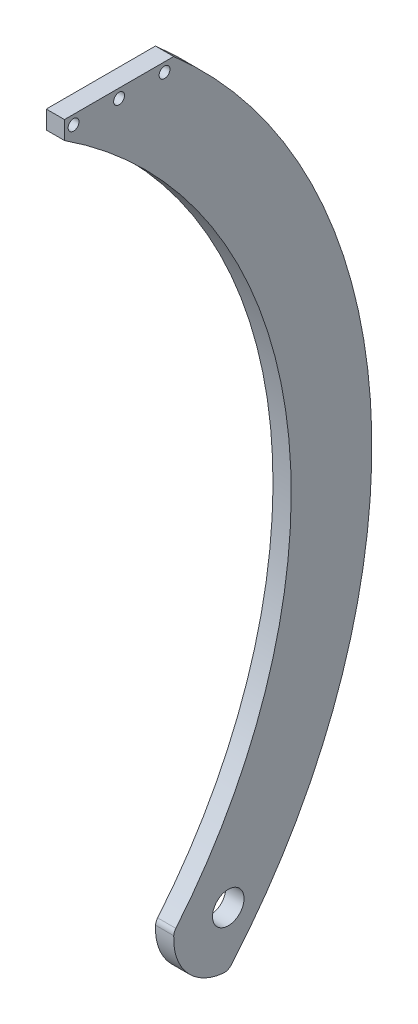
ISO-10303-21;
HEADER;
FILE_DESCRIPTION(('STEP AP214'),'2;1');
FILE_NAME('part.step','',(''),(''),'','','');
FILE_SCHEMA(('AUTOMOTIVE_DESIGN { 1 0 10303 214 1 1 1 1 }'));
ENDSEC;
DATA;
#1=APPLICATION_CONTEXT('core data for automotive mechanical design processes');
#2=APPLICATION_PROTOCOL_DEFINITION('international standard','automotive_design',2000,#1);
#3=PRODUCT_CONTEXT('',#1,'mechanical');
#4=PRODUCT('Part','Part','',(#3));
#5=PRODUCT_RELATED_PRODUCT_CATEGORY('part','',(#4));
#6=PRODUCT_DEFINITION_FORMATION('','',#4);
#7=PRODUCT_DEFINITION_CONTEXT('part definition',#1,'design');
#8=PRODUCT_DEFINITION('design','',#6,#7);
#9=PRODUCT_DEFINITION_SHAPE('','',#8);
#10=(LENGTH_UNIT() NAMED_UNIT(*) SI_UNIT(.MILLI.,.METRE.));
#11=(NAMED_UNIT(*) PLANE_ANGLE_UNIT() SI_UNIT($,.RADIAN.));
#12=(NAMED_UNIT(*) SI_UNIT($,.STERADIAN.) SOLID_ANGLE_UNIT());
#13=UNCERTAINTY_MEASURE_WITH_UNIT(LENGTH_MEASURE(1.E-05),#10,'distance_accuracy_value','');
#14=(GEOMETRIC_REPRESENTATION_CONTEXT(3) GLOBAL_UNCERTAINTY_ASSIGNED_CONTEXT((#13)) GLOBAL_UNIT_ASSIGNED_CONTEXT((#10,
#11,#12)) REPRESENTATION_CONTEXT('',''));
#15=CARTESIAN_POINT('',(0.,0.,0.));
#16=DIRECTION('',(0.,0.,1.));
#17=DIRECTION('',(1.,0.,0.));
#18=AXIS2_PLACEMENT_3D('',#15,#16,#17);
#19=CARTESIAN_POINT('',(6.35,114.3,114.3));
#20=DIRECTION('',(-1.,0.,0.));
#21=DIRECTION('',(0.,0.,1.));
#22=AXIS2_PLACEMENT_3D('',#19,#20,#21);
#23=PLANE('',#22);
#24=CARTESIAN_POINT('',(6.35,263.525,-15.875));
#25=DIRECTION('',(1.,0.,0.));
#26=DIRECTION('',(0.,0.,-1.));
#27=AXIS2_PLACEMENT_3D('',#24,#25,#26);
#28=CIRCLE('',#27,1.89865);
#29=CARTESIAN_POINT('',(6.35,263.525,-17.77365));
#30=VERTEX_POINT('',#29);
#31=EDGE_CURVE('E194',#30,#30,#28,.T.);
#32=ORIENTED_EDGE('',*,*,#31,.F.);
#33=EDGE_LOOP('',(#32));
#34=FACE_BOUND('',#33,.T.);
#35=CARTESIAN_POINT('',(6.35,114.3,114.3));
#36=DIRECTION('',(1.,0.,0.));
#37=DIRECTION('',(0.,0.,1.));
#38=AXIS2_PLACEMENT_3D('',#35,#36,#37);
#39=CIRCLE('',#38,202.504277732595);
#40=CARTESIAN_POINT('',(6.35,-17.8861216095722,-39.1105985706965));
#41=VERTEX_POINT('',#40);
#42=CARTESIAN_POINT('',(6.35,266.7,-19.05));
#43=VERTEX_POINT('',#42);
#44=EDGE_CURVE('E155',#41,#43,#39,.T.);
#45=ORIENTED_EDGE('',*,*,#44,.T.);
#46=DIRECTION('',(0.,0.,1.));
#47=VECTOR('',#46,1.);
#48=CARTESIAN_POINT('',(6.35,266.7,19.05));
#49=LINE('',#48,#47);
#50=CARTESIAN_POINT('',(6.35,266.7,19.05));
#51=VERTEX_POINT('',#50);
#52=EDGE_CURVE('E102',#43,#51,#49,.T.);
#53=ORIENTED_EDGE('',*,*,#52,.T.);
#54=DIRECTION('',(0.,-1.,0.));
#55=VECTOR('',#54,1.);
#56=CARTESIAN_POINT('',(6.35,266.7,19.05));
#57=LINE('',#56,#55);
#58=CARTESIAN_POINT('',(6.35,260.35,19.05));
#59=VERTEX_POINT('',#58);
#60=EDGE_CURVE('E170',#51,#59,#57,.T.);
#61=ORIENTED_EDGE('',*,*,#60,.T.);
#62=CARTESIAN_POINT('',(6.35,114.3,114.3));
#63=DIRECTION('',(-1.,0.,0.));
#64=DIRECTION('',(0.,0.,1.));
#65=AXIS2_PLACEMENT_3D('',#62,#63,#64);
#66=CIRCLE('',#65,174.365033765374);
#67=CARTESIAN_POINT('',(6.35,2.85913384459888,-19.8048036072309));
#68=VERTEX_POINT('',#67);
#69=EDGE_CURVE('E120',#59,#68,#66,.T.);
#70=ORIENTED_EDGE('',*,*,#69,.T.);
#71=CARTESIAN_POINT('',(6.35,0.829915357367626,-22.2467080548043));
#72=DIRECTION('',(1.,0.,0.));
#73=DIRECTION('',(0.,0.,1.));
#74=AXIS2_PLACEMENT_3D('',#71,#72,#73);
#75=CIRCLE('',#74,3.175);
#76=CARTESIAN_POINT('',(6.35,0.99589842884115,-19.0760496657652));
#77=VERTEX_POINT('',#76);
#78=EDGE_CURVE('E114',#68,#77,#75,.T.);
#79=ORIENTED_EDGE('',*,*,#78,.T.);
#80=CARTESIAN_POINT('',(6.35,0.,-38.1));
#81=DIRECTION('',(1.,0.,0.));
#82=DIRECTION('',(0.,0.,-1.));
#83=AXIS2_PLACEMENT_3D('',#80,#81,#82);
#84=CIRCLE('',#83,19.0500000000002);
#85=CARTESIAN_POINT('',(6.35,-18.9763410693101,-36.4263872547024));
#86=VERTEX_POINT('',#85);
#87=EDGE_CURVE('E118',#77,#86,#84,.T.);
#88=ORIENTED_EDGE('',*,*,#87,.T.);
#89=CARTESIAN_POINT('',(6.35,-15.8136175577586,-36.7053227122519));
#90=DIRECTION('',(1.,0.,0.));
#91=DIRECTION('',(0.,0.,-1.));
#92=AXIS2_PLACEMENT_3D('',#89,#90,#91);
#93=CIRCLE('',#92,3.175);
#94=EDGE_CURVE('E58',#86,#41,#93,.T.);
#95=ORIENTED_EDGE('',*,*,#94,.T.);
#96=EDGE_LOOP('',(#45,#53,#61,#70,#79,#88,#95));
#97=FACE_BOUND('',#96,.T.);
#98=CARTESIAN_POINT('',(6.35,0.,-38.1));
#99=DIRECTION('',(1.,0.,0.));
#100=DIRECTION('',(0.,0.,-1.));
#101=AXIS2_PLACEMENT_3D('',#98,#99,#100);
#102=CIRCLE('',#101,5.5);
#103=CARTESIAN_POINT('',(6.35,0.,-43.6));
#104=VERTEX_POINT('',#103);
#105=EDGE_CURVE('E143',#104,#104,#102,.T.);
#106=ORIENTED_EDGE('',*,*,#105,.F.);
#107=EDGE_LOOP('',(#106));
#108=FACE_BOUND('',#107,.T.);
#109=CARTESIAN_POINT('',(6.35,263.525,0.));
#110=DIRECTION('',(1.,0.,0.));
#111=DIRECTION('',(0.,0.,-1.));
#112=AXIS2_PLACEMENT_3D('',#109,#110,#111);
#113=CIRCLE('',#112,1.89865);
#114=CARTESIAN_POINT('',(6.35,263.525,-1.89865000000001));
#115=VERTEX_POINT('',#114);
#116=EDGE_CURVE('E202',#115,#115,#113,.T.);
#117=ORIENTED_EDGE('',*,*,#116,.F.);
#118=EDGE_LOOP('',(#117));
#119=FACE_BOUND('',#118,.T.);
#120=CARTESIAN_POINT('',(6.35,263.525,15.875));
#121=DIRECTION('',(1.,0.,0.));
#122=DIRECTION('',(0.,0.,-1.));
#123=AXIS2_PLACEMENT_3D('',#120,#121,#122);
#124=CIRCLE('',#123,1.89865);
#125=CARTESIAN_POINT('',(6.35,263.525,13.97635));
#126=VERTEX_POINT('',#125);
#127=EDGE_CURVE('E210',#126,#126,#124,.T.);
#128=ORIENTED_EDGE('',*,*,#127,.F.);
#129=EDGE_LOOP('',(#128));
#130=FACE_BOUND('',#129,.T.);
#131=ADVANCED_FACE('F40',(#34,#97,#108,#119,#130),#23,.F.);
#132=CARTESIAN_POINT('',(0.,114.3,114.3));
#133=DIRECTION('',(-1.,0.,0.));
#134=DIRECTION('',(0.,0.,1.));
#135=AXIS2_PLACEMENT_3D('',#132,#133,#134);
#136=PLANE('',#135);
#137=CARTESIAN_POINT('',(0.,263.525,15.875));
#138=DIRECTION('',(-1.,0.,0.));
#139=DIRECTION('',(0.,0.,1.));
#140=AXIS2_PLACEMENT_3D('',#137,#138,#139);
#141=CIRCLE('',#140,1.89865);
#142=CARTESIAN_POINT('',(0.,263.525,17.77365));
#143=VERTEX_POINT('',#142);
#144=EDGE_CURVE('E206',#143,#143,#141,.T.);
#145=ORIENTED_EDGE('',*,*,#144,.F.);
#146=EDGE_LOOP('',(#145));
#147=FACE_BOUND('',#146,.T.);
#148=CARTESIAN_POINT('',(0.,263.525,0.));
#149=DIRECTION('',(-1.,0.,0.));
#150=DIRECTION('',(0.,0.,1.));
#151=AXIS2_PLACEMENT_3D('',#148,#149,#150);
#152=CIRCLE('',#151,1.89865);
#153=CARTESIAN_POINT('',(0.,263.525,1.89865));
#154=VERTEX_POINT('',#153);
#155=EDGE_CURVE('E198',#154,#154,#152,.T.);
#156=ORIENTED_EDGE('',*,*,#155,.F.);
#157=EDGE_LOOP('',(#156));
#158=FACE_BOUND('',#157,.T.);
#159=CARTESIAN_POINT('',(0.,263.525,-15.875));
#160=DIRECTION('',(-1.,0.,0.));
#161=DIRECTION('',(0.,0.,1.));
#162=AXIS2_PLACEMENT_3D('',#159,#160,#161);
#163=CIRCLE('',#162,1.89865);
#164=CARTESIAN_POINT('',(0.,263.525,-13.97635));
#165=VERTEX_POINT('',#164);
#166=EDGE_CURVE('E188',#165,#165,#163,.T.);
#167=ORIENTED_EDGE('',*,*,#166,.F.);
#168=EDGE_LOOP('',(#167));
#169=FACE_BOUND('',#168,.T.);
#170=CARTESIAN_POINT('',(0.,114.3,114.3));
#171=DIRECTION('',(1.,0.,0.));
#172=DIRECTION('',(0.,0.,1.));
#173=AXIS2_PLACEMENT_3D('',#170,#171,#172);
#174=CIRCLE('',#173,202.504277732595);
#175=CARTESIAN_POINT('',(0.,-17.8861216095722,-39.1105985706965));
#176=VERTEX_POINT('',#175);
#177=CARTESIAN_POINT('',(0.,266.7,-19.05));
#178=VERTEX_POINT('',#177);
#179=EDGE_CURVE('E138',#176,#178,#174,.T.);
#180=ORIENTED_EDGE('',*,*,#179,.F.);
#181=CARTESIAN_POINT('',(0.,-15.8136175577586,-36.7053227122519));
#182=DIRECTION('',(1.,0.,0.));
#183=DIRECTION('',(0.,0.,-1.));
#184=AXIS2_PLACEMENT_3D('',#181,#182,#183);
#185=CIRCLE('',#184,3.175);
#186=CARTESIAN_POINT('',(0.,-18.9763410693101,-36.4263872547024));
#187=VERTEX_POINT('',#186);
#188=EDGE_CURVE('E93',#187,#176,#185,.T.);
#189=ORIENTED_EDGE('',*,*,#188,.F.);
#190=CARTESIAN_POINT('',(0.,0.,-38.1));
#191=DIRECTION('',(1.,0.,0.));
#192=DIRECTION('',(0.,0.,-1.));
#193=AXIS2_PLACEMENT_3D('',#190,#191,#192);
#194=CIRCLE('',#193,19.0500000000002);
#195=CARTESIAN_POINT('',(0.,0.99589842884115,-19.0760496657652));
#196=VERTEX_POINT('',#195);
#197=EDGE_CURVE('E87',#196,#187,#194,.T.);
#198=ORIENTED_EDGE('',*,*,#197,.F.);
#199=CARTESIAN_POINT('',(0.,0.829915357367626,-22.2467080548043));
#200=DIRECTION('',(1.,0.,0.));
#201=DIRECTION('',(0.,0.,1.));
#202=AXIS2_PLACEMENT_3D('',#199,#200,#201);
#203=CIRCLE('',#202,3.175);
#204=CARTESIAN_POINT('',(0.,2.85913384459888,-19.8048036072309));
#205=VERTEX_POINT('',#204);
#206=EDGE_CURVE('E128',#205,#196,#203,.T.);
#207=ORIENTED_EDGE('',*,*,#206,.F.);
#208=CARTESIAN_POINT('',(0.,114.3,114.3));
#209=DIRECTION('',(-1.,0.,0.));
#210=DIRECTION('',(0.,0.,1.));
#211=AXIS2_PLACEMENT_3D('',#208,#209,#210);
#212=CIRCLE('',#211,174.365033765374);
#213=CARTESIAN_POINT('',(0.,260.35,19.05));
#214=VERTEX_POINT('',#213);
#215=EDGE_CURVE('E149',#214,#205,#212,.T.);
#216=ORIENTED_EDGE('',*,*,#215,.F.);
#217=DIRECTION('',(0.,-1.,0.));
#218=VECTOR('',#217,1.);
#219=CARTESIAN_POINT('',(0.,266.7,19.05));
#220=LINE('',#219,#218);
#221=CARTESIAN_POINT('',(0.,266.7,19.05));
#222=VERTEX_POINT('',#221);
#223=EDGE_CURVE('E146',#222,#214,#220,.T.);
#224=ORIENTED_EDGE('',*,*,#223,.F.);
#225=DIRECTION('',(0.,0.,1.));
#226=VECTOR('',#225,1.);
#227=CARTESIAN_POINT('',(0.,266.7,19.05));
#228=LINE('',#227,#226);
#229=EDGE_CURVE('E142',#178,#222,#228,.T.);
#230=ORIENTED_EDGE('',*,*,#229,.F.);
#231=EDGE_LOOP('',(#180,#189,#198,#207,#216,#224,#230));
#232=FACE_BOUND('',#231,.T.);
#233=CARTESIAN_POINT('',(0.,0.,-38.1));
#234=DIRECTION('',(1.,0.,0.));
#235=DIRECTION('',(0.,0.,-1.));
#236=AXIS2_PLACEMENT_3D('',#233,#234,#235);
#237=CIRCLE('',#236,5.5);
#238=CARTESIAN_POINT('',(0.,0.,-43.6));
#239=VERTEX_POINT('',#238);
#240=EDGE_CURVE('E185',#239,#239,#237,.T.);
#241=ORIENTED_EDGE('',*,*,#240,.T.);
#242=EDGE_LOOP('',(#241));
#243=FACE_BOUND('',#242,.T.);
#244=ADVANCED_FACE('F174',(#147,#158,#169,#232,#243),#136,.T.);
#245=CARTESIAN_POINT('',(6.35,114.3,114.3));
#246=DIRECTION('',(-1.,0.,0.));
#247=DIRECTION('',(0.,0.,1.));
#248=AXIS2_PLACEMENT_3D('',#245,#246,#247);
#249=CYLINDRICAL_SURFACE('',#248,202.504277732595);
#250=ORIENTED_EDGE('',*,*,#179,.T.);
#251=DIRECTION('',(-1.,0.,0.));
#252=VECTOR('',#251,1.);
#253=CARTESIAN_POINT('',(6.35,266.7,-19.05));
#254=LINE('',#253,#252);
#255=EDGE_CURVE('E11',#43,#178,#254,.T.);
#256=ORIENTED_EDGE('',*,*,#255,.F.);
#257=ORIENTED_EDGE('',*,*,#44,.F.);
#258=DIRECTION('',(-1.,0.,0.));
#259=VECTOR('',#258,1.);
#260=CARTESIAN_POINT('',(6.35,-17.8861216095722,-39.1105985706965));
#261=LINE('',#260,#259);
#262=EDGE_CURVE('E134',#41,#176,#261,.T.);
#263=ORIENTED_EDGE('',*,*,#262,.T.);
#264=EDGE_LOOP('',(#250,#256,#257,#263));
#265=FACE_BOUND('',#264,.T.);
#266=ADVANCED_FACE('F42',(#265),#249,.T.);
#267=CARTESIAN_POINT('',(6.35,266.7,19.05));
#268=DIRECTION('',(0.,-1.,0.));
#269=DIRECTION('',(0.,0.,-1.));
#270=AXIS2_PLACEMENT_3D('',#267,#268,#269);
#271=PLANE('',#270);
#272=ORIENTED_EDGE('',*,*,#229,.T.);
#273=DIRECTION('',(-1.,0.,0.));
#274=VECTOR('',#273,1.);
#275=CARTESIAN_POINT('',(6.35,266.7,19.05));
#276=LINE('',#275,#274);
#277=EDGE_CURVE('E50',#51,#222,#276,.T.);
#278=ORIENTED_EDGE('',*,*,#277,.F.);
#279=ORIENTED_EDGE('',*,*,#52,.F.);
#280=ORIENTED_EDGE('',*,*,#255,.T.);
#281=EDGE_LOOP('',(#272,#278,#279,#280));
#282=FACE_BOUND('',#281,.T.);
#283=ADVANCED_FACE('F241',(#282),#271,.F.);
#284=CARTESIAN_POINT('',(6.35,266.7,19.05));
#285=DIRECTION('',(0.,0.,-1.));
#286=DIRECTION('',(0.,1.,0.));
#287=AXIS2_PLACEMENT_3D('',#284,#285,#286);
#288=PLANE('',#287);
#289=ORIENTED_EDGE('',*,*,#223,.T.);
#290=DIRECTION('',(-1.,0.,0.));
#291=VECTOR('',#290,1.);
#292=CARTESIAN_POINT('',(6.35,260.35,19.05));
#293=LINE('',#292,#291);
#294=EDGE_CURVE('E159',#59,#214,#293,.T.);
#295=ORIENTED_EDGE('',*,*,#294,.F.);
#296=ORIENTED_EDGE('',*,*,#60,.F.);
#297=ORIENTED_EDGE('',*,*,#277,.T.);
#298=EDGE_LOOP('',(#289,#295,#296,#297));
#299=FACE_BOUND('',#298,.T.);
#300=ADVANCED_FACE('F168',(#299),#288,.F.);
#301=CARTESIAN_POINT('',(6.35,114.3,114.3));
#302=DIRECTION('',(-1.,0.,0.));
#303=DIRECTION('',(0.,0.,1.));
#304=AXIS2_PLACEMENT_3D('',#301,#302,#303);
#305=CYLINDRICAL_SURFACE('',#304,174.365033765374);
#306=ORIENTED_EDGE('',*,*,#215,.T.);
#307=DIRECTION('',(-1.,0.,0.));
#308=VECTOR('',#307,1.);
#309=CARTESIAN_POINT('',(6.35,2.85913384459888,-19.8048036072309));
#310=LINE('',#309,#308);
#311=EDGE_CURVE('E129',#68,#205,#310,.T.);
#312=ORIENTED_EDGE('',*,*,#311,.F.);
#313=ORIENTED_EDGE('',*,*,#69,.F.);
#314=ORIENTED_EDGE('',*,*,#294,.T.);
#315=EDGE_LOOP('',(#306,#312,#313,#314));
#316=FACE_BOUND('',#315,.T.);
#317=ADVANCED_FACE('F177',(#316),#305,.F.);
#318=CARTESIAN_POINT('',(6.35,0.829915357367626,-22.2467080548043));
#319=DIRECTION('',(-1.,0.,0.));
#320=DIRECTION('',(0.,0.,1.));
#321=AXIS2_PLACEMENT_3D('',#318,#319,#320);
#322=CYLINDRICAL_SURFACE('',#321,3.175);
#323=ORIENTED_EDGE('',*,*,#206,.T.);
#324=DIRECTION('',(-1.,0.,0.));
#325=VECTOR('',#324,1.);
#326=CARTESIAN_POINT('',(6.35,0.99589842884115,-19.0760496657652));
#327=LINE('',#326,#325);
#328=EDGE_CURVE('E125',#77,#196,#327,.T.);
#329=ORIENTED_EDGE('',*,*,#328,.F.);
#330=ORIENTED_EDGE('',*,*,#78,.F.);
#331=ORIENTED_EDGE('',*,*,#311,.T.);
#332=EDGE_LOOP('',(#323,#329,#330,#331));
#333=FACE_BOUND('',#332,.T.);
#334=ADVANCED_FACE('F126',(#333),#322,.T.);
#335=CARTESIAN_POINT('',(6.35,0.,-38.1));
#336=DIRECTION('',(-1.,0.,0.));
#337=DIRECTION('',(0.,0.,1.));
#338=AXIS2_PLACEMENT_3D('',#335,#336,#337);
#339=CYLINDRICAL_SURFACE('',#338,19.0500000000002);
#340=ORIENTED_EDGE('',*,*,#197,.T.);
#341=DIRECTION('',(-1.,0.,0.));
#342=VECTOR('',#341,1.);
#343=CARTESIAN_POINT('',(6.35,-18.9763410693101,-36.4263872547024));
#344=LINE('',#343,#342);
#345=EDGE_CURVE('E130',#86,#187,#344,.T.);
#346=ORIENTED_EDGE('',*,*,#345,.F.);
#347=ORIENTED_EDGE('',*,*,#87,.F.);
#348=ORIENTED_EDGE('',*,*,#328,.T.);
#349=EDGE_LOOP('',(#340,#346,#347,#348));
#350=FACE_BOUND('',#349,.T.);
#351=ADVANCED_FACE('F132',(#350),#339,.T.);
#352=CARTESIAN_POINT('',(6.35,-15.8136175577586,-36.7053227122519));
#353=DIRECTION('',(-1.,0.,0.));
#354=DIRECTION('',(0.,0.,1.));
#355=AXIS2_PLACEMENT_3D('',#352,#353,#354);
#356=CYLINDRICAL_SURFACE('',#355,3.175);
#357=ORIENTED_EDGE('',*,*,#188,.T.);
#358=ORIENTED_EDGE('',*,*,#262,.F.);
#359=ORIENTED_EDGE('',*,*,#94,.F.);
#360=ORIENTED_EDGE('',*,*,#345,.T.);
#361=EDGE_LOOP('',(#357,#358,#359,#360));
#362=FACE_BOUND('',#361,.T.);
#363=ADVANCED_FACE('F231',(#362),#356,.T.);
#364=CARTESIAN_POINT('',(6.35,0.,-38.1));
#365=DIRECTION('',(-1.,0.,0.));
#366=DIRECTION('',(0.,0.,1.));
#367=AXIS2_PLACEMENT_3D('',#364,#365,#366);
#368=CYLINDRICAL_SURFACE('',#367,5.5);
#369=ORIENTED_EDGE('',*,*,#105,.T.);
#370=EDGE_LOOP('',(#369));
#371=FACE_BOUND('',#370,.T.);
#372=ORIENTED_EDGE('',*,*,#240,.F.);
#373=EDGE_LOOP('',(#372));
#374=FACE_BOUND('',#373,.T.);
#375=ADVANCED_FACE('F228',(#371,#374),#368,.F.);
#376=CARTESIAN_POINT('',(6.35,263.525,-15.875));
#377=DIRECTION('',(1.,0.,0.));
#378=DIRECTION('',(0.,0.,-1.));
#379=AXIS2_PLACEMENT_3D('',#376,#377,#378);
#380=CYLINDRICAL_SURFACE('',#379,1.89865);
#381=ORIENTED_EDGE('',*,*,#31,.T.);
#382=EDGE_LOOP('',(#381));
#383=FACE_BOUND('',#382,.T.);
#384=ORIENTED_EDGE('',*,*,#166,.T.);
#385=EDGE_LOOP('',(#384));
#386=FACE_BOUND('',#385,.T.);
#387=ADVANCED_FACE('F282',(#383,#386),#380,.F.);
#388=CARTESIAN_POINT('',(6.35,263.525,0.));
#389=DIRECTION('',(1.,0.,0.));
#390=DIRECTION('',(0.,0.,-1.));
#391=AXIS2_PLACEMENT_3D('',#388,#389,#390);
#392=CYLINDRICAL_SURFACE('',#391,1.89865);
#393=ORIENTED_EDGE('',*,*,#116,.T.);
#394=EDGE_LOOP('',(#393));
#395=FACE_BOUND('',#394,.T.);
#396=ORIENTED_EDGE('',*,*,#155,.T.);
#397=EDGE_LOOP('',(#396));
#398=FACE_BOUND('',#397,.T.);
#399=ADVANCED_FACE('F288',(#395,#398),#392,.F.);
#400=CARTESIAN_POINT('',(6.35,263.525,15.875));
#401=DIRECTION('',(1.,0.,0.));
#402=DIRECTION('',(0.,0.,-1.));
#403=AXIS2_PLACEMENT_3D('',#400,#401,#402);
#404=CYLINDRICAL_SURFACE('',#403,1.89865);
#405=ORIENTED_EDGE('',*,*,#127,.T.);
#406=EDGE_LOOP('',(#405));
#407=FACE_BOUND('',#406,.T.);
#408=ORIENTED_EDGE('',*,*,#144,.T.);
#409=EDGE_LOOP('',(#408));
#410=FACE_BOUND('',#409,.T.);
#411=ADVANCED_FACE('F215',(#407,#410),#404,.F.);
#412=CLOSED_SHELL('',(#131,#244,#266,#283,#300,#317,#334,#351,#363,#375,#387,#399,#411));
#413=MANIFOLD_SOLID_BREP('B2',#412);
#414=ADVANCED_BREP_SHAPE_REPRESENTATION('',(#18,#413),#14);
#415=SHAPE_DEFINITION_REPRESENTATION(#9,#414);
ENDSEC;
END-ISO-10303-21;
